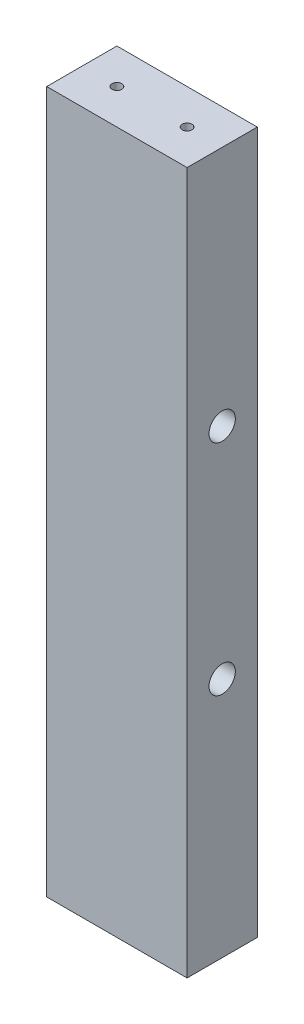
ISO-10303-21;
HEADER;
FILE_DESCRIPTION(('STEP AP214'),'2;1');
FILE_NAME('part.step','',(''),(''),'','','');
FILE_SCHEMA(('AUTOMOTIVE_DESIGN { 1 0 10303 214 1 1 1 1 }'));
ENDSEC;
DATA;
#1=APPLICATION_CONTEXT('core data for automotive mechanical design processes');
#2=APPLICATION_PROTOCOL_DEFINITION('international standard','automotive_design',2000,#1);
#3=PRODUCT_CONTEXT('',#1,'mechanical');
#4=PRODUCT('Part','Part','',(#3));
#5=PRODUCT_RELATED_PRODUCT_CATEGORY('part','',(#4));
#6=PRODUCT_DEFINITION_FORMATION('','',#4);
#7=PRODUCT_DEFINITION_CONTEXT('part definition',#1,'design');
#8=PRODUCT_DEFINITION('design','',#6,#7);
#9=PRODUCT_DEFINITION_SHAPE('','',#8);
#10=(LENGTH_UNIT() NAMED_UNIT(*) SI_UNIT(.MILLI.,.METRE.));
#11=(NAMED_UNIT(*) PLANE_ANGLE_UNIT() SI_UNIT($,.RADIAN.));
#12=(NAMED_UNIT(*) SI_UNIT($,.STERADIAN.) SOLID_ANGLE_UNIT());
#13=UNCERTAINTY_MEASURE_WITH_UNIT(LENGTH_MEASURE(1.E-05),#10,'distance_accuracy_value','');
#14=(GEOMETRIC_REPRESENTATION_CONTEXT(3) GLOBAL_UNCERTAINTY_ASSIGNED_CONTEXT((#13)) GLOBAL_UNIT_ASSIGNED_CONTEXT((#10,
#11,#12)) REPRESENTATION_CONTEXT('',''));
#15=CARTESIAN_POINT('',(0.,0.,0.));
#16=DIRECTION('',(0.,0.,1.));
#17=DIRECTION('',(1.,0.,0.));
#18=AXIS2_PLACEMENT_3D('',#15,#16,#17);
#19=CARTESIAN_POINT('',(-12.7,-19.812,0.));
#20=DIRECTION('',(1.,0.,0.));
#21=DIRECTION('',(0.,0.,-1.));
#22=AXIS2_PLACEMENT_3D('',#19,#20,#21);
#23=CYLINDRICAL_SURFACE('',#22,1.190625);
#24=CARTESIAN_POINT('',(-12.7,-19.812,0.));
#25=DIRECTION('',(1.,0.,0.));
#26=DIRECTION('',(0.,0.,-1.));
#27=AXIS2_PLACEMENT_3D('',#24,#25,#26);
#28=CIRCLE('',#27,1.190625);
#29=CARTESIAN_POINT('',(-12.7,-19.812,-1.190625));
#30=VERTEX_POINT('',#29);
#31=EDGE_CURVE('E143',#30,#30,#28,.T.);
#32=ORIENTED_EDGE('',*,*,#31,.F.);
#33=EDGE_LOOP('',(#32));
#34=FACE_BOUND('',#33,.T.);
#35=CARTESIAN_POINT('',(3.175,-19.812,0.));
#36=DIRECTION('',(1.,0.,0.));
#37=DIRECTION('',(0.,0.,-1.));
#38=AXIS2_PLACEMENT_3D('',#35,#36,#37);
#39=CIRCLE('',#38,1.190625);
#40=CARTESIAN_POINT('',(3.175,-19.812,-1.190625));
#41=VERTEX_POINT('',#40);
#42=EDGE_CURVE('E127',#41,#41,#39,.T.);
#43=ORIENTED_EDGE('',*,*,#42,.T.);
#44=EDGE_LOOP('',(#43));
#45=FACE_BOUND('',#44,.T.);
#46=ADVANCED_FACE('F33',(#34,#45),#23,.F.);
#47=CARTESIAN_POINT('',(-12.7,19.812,0.));
#48=DIRECTION('',(1.,0.,0.));
#49=DIRECTION('',(0.,0.,-1.));
#50=AXIS2_PLACEMENT_3D('',#47,#48,#49);
#51=CYLINDRICAL_SURFACE('',#50,1.190625);
#52=CARTESIAN_POINT('',(-12.7,19.812,0.));
#53=DIRECTION('',(1.,0.,0.));
#54=DIRECTION('',(0.,0.,-1.));
#55=AXIS2_PLACEMENT_3D('',#52,#53,#54);
#56=CIRCLE('',#55,1.190625);
#57=CARTESIAN_POINT('',(-12.7,19.812,-1.190625));
#58=VERTEX_POINT('',#57);
#59=EDGE_CURVE('E148',#58,#58,#56,.T.);
#60=ORIENTED_EDGE('',*,*,#59,.F.);
#61=EDGE_LOOP('',(#60));
#62=FACE_BOUND('',#61,.T.);
#63=CARTESIAN_POINT('',(3.175,19.812,0.));
#64=DIRECTION('',(1.,0.,0.));
#65=DIRECTION('',(0.,0.,-1.));
#66=AXIS2_PLACEMENT_3D('',#63,#64,#65);
#67=CIRCLE('',#66,1.190625);
#68=CARTESIAN_POINT('',(3.175,19.812,-1.190625));
#69=VERTEX_POINT('',#68);
#70=EDGE_CURVE('E134',#69,#69,#67,.T.);
#71=ORIENTED_EDGE('',*,*,#70,.T.);
#72=EDGE_LOOP('',(#71));
#73=FACE_BOUND('',#72,.T.);
#74=ADVANCED_FACE('F192',(#62,#73),#51,.F.);
#75=CARTESIAN_POINT('',(12.7,-63.5,6.35));
#76=DIRECTION('',(-1.,0.,0.));
#77=DIRECTION('',(0.,0.,1.));
#78=AXIS2_PLACEMENT_3D('',#75,#76,#77);
#79=PLANE('',#78);
#80=CARTESIAN_POINT('',(12.7,-19.812,0.));
#81=DIRECTION('',(1.,0.,0.));
#82=DIRECTION('',(0.,0.,-1.));
#83=AXIS2_PLACEMENT_3D('',#80,#81,#82);
#84=CIRCLE('',#83,2.38125);
#85=CARTESIAN_POINT('',(12.7,-19.812,-2.38125));
#86=VERTEX_POINT('',#85);
#87=EDGE_CURVE('E130',#86,#86,#84,.T.);
#88=ORIENTED_EDGE('',*,*,#87,.F.);
#89=EDGE_LOOP('',(#88));
#90=FACE_BOUND('',#89,.T.);
#91=CARTESIAN_POINT('',(12.7,19.812,0.));
#92=DIRECTION('',(1.,0.,0.));
#93=DIRECTION('',(0.,0.,-1.));
#94=AXIS2_PLACEMENT_3D('',#91,#92,#93);
#95=CIRCLE('',#94,2.38125);
#96=CARTESIAN_POINT('',(12.7,19.812,-2.38125));
#97=VERTEX_POINT('',#96);
#98=EDGE_CURVE('E139',#97,#97,#95,.T.);
#99=ORIENTED_EDGE('',*,*,#98,.F.);
#100=EDGE_LOOP('',(#99));
#101=FACE_BOUND('',#100,.T.);
#102=DIRECTION('',(0.,1.,0.));
#103=VECTOR('',#102,1.);
#104=CARTESIAN_POINT('',(12.7,-63.5,-6.35));
#105=LINE('',#104,#103);
#106=CARTESIAN_POINT('',(12.7,-63.5,-6.35));
#107=VERTEX_POINT('',#106);
#108=CARTESIAN_POINT('',(12.7,63.5,-6.35));
#109=VERTEX_POINT('',#108);
#110=EDGE_CURVE('E151',#107,#109,#105,.T.);
#111=ORIENTED_EDGE('',*,*,#110,.T.);
#112=DIRECTION('',(0.,0.,-1.));
#113=VECTOR('',#112,1.);
#114=CARTESIAN_POINT('',(12.7,63.5,6.35));
#115=LINE('',#114,#113);
#116=CARTESIAN_POINT('',(12.7,63.5,6.35));
#117=VERTEX_POINT('',#116);
#118=EDGE_CURVE('E11',#117,#109,#115,.T.);
#119=ORIENTED_EDGE('',*,*,#118,.F.);
#120=DIRECTION('',(0.,1.,0.));
#121=VECTOR('',#120,1.);
#122=CARTESIAN_POINT('',(12.7,-63.5,6.35));
#123=LINE('',#122,#121);
#124=CARTESIAN_POINT('',(12.7,-63.5,6.35));
#125=VERTEX_POINT('',#124);
#126=EDGE_CURVE('E152',#125,#117,#123,.T.);
#127=ORIENTED_EDGE('',*,*,#126,.F.);
#128=DIRECTION('',(0.,0.,-1.));
#129=VECTOR('',#128,1.);
#130=CARTESIAN_POINT('',(12.7,-63.5,6.35));
#131=LINE('',#130,#129);
#132=EDGE_CURVE('E158',#125,#107,#131,.T.);
#133=ORIENTED_EDGE('',*,*,#132,.T.);
#134=EDGE_LOOP('',(#111,#119,#127,#133));
#135=FACE_BOUND('',#134,.T.);
#136=ADVANCED_FACE('F35',(#90,#101,#135),#79,.F.);
#137=CARTESIAN_POINT('',(-12.7,63.5,6.35));
#138=DIRECTION('',(0.,-1.,0.));
#139=DIRECTION('',(0.,0.,-1.));
#140=AXIS2_PLACEMENT_3D('',#137,#138,#139);
#141=PLANE('',#140);
#142=CARTESIAN_POINT('',(-6.35000000000004,63.5,0.));
#143=DIRECTION('',(0.,1.,0.));
#144=DIRECTION('',(0.,0.,1.));
#145=AXIS2_PLACEMENT_3D('',#142,#143,#144);
#146=CIRCLE('',#145,0.888999999999989);
#147=CARTESIAN_POINT('',(-6.35000000000004,63.5,0.889000000000044));
#148=VERTEX_POINT('',#147);
#149=EDGE_CURVE('E115',#148,#148,#146,.T.);
#150=ORIENTED_EDGE('',*,*,#149,.F.);
#151=EDGE_LOOP('',(#150));
#152=FACE_BOUND('',#151,.T.);
#153=CARTESIAN_POINT('',(6.34999999999996,63.5,0.));
#154=DIRECTION('',(0.,1.,0.));
#155=DIRECTION('',(0.,0.,1.));
#156=AXIS2_PLACEMENT_3D('',#153,#154,#155);
#157=CIRCLE('',#156,0.888999999999989);
#158=CARTESIAN_POINT('',(6.34999999999996,63.5,0.889000000000044));
#159=VERTEX_POINT('',#158);
#160=EDGE_CURVE('E121',#159,#159,#157,.T.);
#161=ORIENTED_EDGE('',*,*,#160,.F.);
#162=EDGE_LOOP('',(#161));
#163=FACE_BOUND('',#162,.T.);
#164=DIRECTION('',(-1.,0.,0.));
#165=VECTOR('',#164,1.);
#166=CARTESIAN_POINT('',(-12.7,63.5,-6.35));
#167=LINE('',#166,#165);
#168=CARTESIAN_POINT('',(-12.7,63.5,-6.35));
#169=VERTEX_POINT('',#168);
#170=EDGE_CURVE('E161',#109,#169,#167,.T.);
#171=ORIENTED_EDGE('',*,*,#170,.T.);
#172=DIRECTION('',(0.,0.,-1.));
#173=VECTOR('',#172,1.);
#174=CARTESIAN_POINT('',(-12.7,63.5,6.35));
#175=LINE('',#174,#173);
#176=CARTESIAN_POINT('',(-12.7,63.5,6.35));
#177=VERTEX_POINT('',#176);
#178=EDGE_CURVE('E42',#177,#169,#175,.T.);
#179=ORIENTED_EDGE('',*,*,#178,.F.);
#180=DIRECTION('',(-1.,0.,0.));
#181=VECTOR('',#180,1.);
#182=CARTESIAN_POINT('',(-12.7,63.5,6.35));
#183=LINE('',#182,#181);
#184=EDGE_CURVE('E81',#117,#177,#183,.T.);
#185=ORIENTED_EDGE('',*,*,#184,.F.);
#186=ORIENTED_EDGE('',*,*,#118,.T.);
#187=EDGE_LOOP('',(#171,#179,#185,#186));
#188=FACE_BOUND('',#187,.T.);
#189=ADVANCED_FACE('F185',(#152,#163,#188),#141,.F.);
#190=CARTESIAN_POINT('',(-12.7,-63.5,6.35));
#191=DIRECTION('',(1.,0.,0.));
#192=DIRECTION('',(0.,0.,-1.));
#193=AXIS2_PLACEMENT_3D('',#190,#191,#192);
#194=PLANE('',#193);
#195=ORIENTED_EDGE('',*,*,#31,.T.);
#196=EDGE_LOOP('',(#195));
#197=FACE_BOUND('',#196,.T.);
#198=ORIENTED_EDGE('',*,*,#59,.T.);
#199=EDGE_LOOP('',(#198));
#200=FACE_BOUND('',#199,.T.);
#201=DIRECTION('',(0.,-1.,0.));
#202=VECTOR('',#201,1.);
#203=CARTESIAN_POINT('',(-12.7,-63.5,-6.35));
#204=LINE('',#203,#202);
#205=CARTESIAN_POINT('',(-12.7,-63.5,-6.35));
#206=VERTEX_POINT('',#205);
#207=EDGE_CURVE('E68',#169,#206,#204,.T.);
#208=ORIENTED_EDGE('',*,*,#207,.T.);
#209=DIRECTION('',(0.,0.,-1.));
#210=VECTOR('',#209,1.);
#211=CARTESIAN_POINT('',(-12.7,-63.5,6.35));
#212=LINE('',#211,#210);
#213=CARTESIAN_POINT('',(-12.7,-63.5,6.35));
#214=VERTEX_POINT('',#213);
#215=EDGE_CURVE('E166',#214,#206,#212,.T.);
#216=ORIENTED_EDGE('',*,*,#215,.F.);
#217=DIRECTION('',(0.,-1.,0.));
#218=VECTOR('',#217,1.);
#219=CARTESIAN_POINT('',(-12.7,-63.5,6.35));
#220=LINE('',#219,#218);
#221=EDGE_CURVE('E155',#177,#214,#220,.T.);
#222=ORIENTED_EDGE('',*,*,#221,.F.);
#223=ORIENTED_EDGE('',*,*,#178,.T.);
#224=EDGE_LOOP('',(#208,#216,#222,#223));
#225=FACE_BOUND('',#224,.T.);
#226=ADVANCED_FACE('F168',(#197,#200,#225),#194,.F.);
#227=CARTESIAN_POINT('',(-12.7,-63.5,6.35));
#228=DIRECTION('',(0.,1.,0.));
#229=DIRECTION('',(0.,0.,1.));
#230=AXIS2_PLACEMENT_3D('',#227,#228,#229);
#231=PLANE('',#230);
#232=CARTESIAN_POINT('',(6.34999999999996,-63.5,0.));
#233=DIRECTION('',(0.,-1.,0.));
#234=DIRECTION('',(0.,0.,-1.));
#235=AXIS2_PLACEMENT_3D('',#232,#233,#234);
#236=CIRCLE('',#235,0.888999999999989);
#237=CARTESIAN_POINT('',(6.34999999999996,-63.5,-0.888999999999892));
#238=VERTEX_POINT('',#237);
#239=EDGE_CURVE('E105',#238,#238,#236,.T.);
#240=ORIENTED_EDGE('',*,*,#239,.F.);
#241=EDGE_LOOP('',(#240));
#242=FACE_BOUND('',#241,.T.);
#243=CARTESIAN_POINT('',(-6.35000000000004,-63.5,0.));
#244=DIRECTION('',(0.,-1.,0.));
#245=DIRECTION('',(0.,0.,-1.));
#246=AXIS2_PLACEMENT_3D('',#243,#244,#245);
#247=CIRCLE('',#246,0.888999999999989);
#248=CARTESIAN_POINT('',(-6.35000000000004,-63.5,-0.888999999999892));
#249=VERTEX_POINT('',#248);
#250=EDGE_CURVE('E104',#249,#249,#247,.T.);
#251=ORIENTED_EDGE('',*,*,#250,.F.);
#252=EDGE_LOOP('',(#251));
#253=FACE_BOUND('',#252,.T.);
#254=DIRECTION('',(1.,0.,0.));
#255=VECTOR('',#254,1.);
#256=CARTESIAN_POINT('',(-12.7,-63.5,-6.35));
#257=LINE('',#256,#255);
#258=EDGE_CURVE('E74',#206,#107,#257,.T.);
#259=ORIENTED_EDGE('',*,*,#258,.T.);
#260=ORIENTED_EDGE('',*,*,#132,.F.);
#261=DIRECTION('',(1.,0.,0.));
#262=VECTOR('',#261,1.);
#263=CARTESIAN_POINT('',(-12.7,-63.5,6.35));
#264=LINE('',#263,#262);
#265=EDGE_CURVE('E50',#214,#125,#264,.T.);
#266=ORIENTED_EDGE('',*,*,#265,.F.);
#267=ORIENTED_EDGE('',*,*,#215,.T.);
#268=EDGE_LOOP('',(#259,#260,#266,#267));
#269=FACE_BOUND('',#268,.T.);
#270=ADVANCED_FACE('F175',(#242,#253,#269),#231,.F.);
#271=CARTESIAN_POINT('',(12.7,63.5,6.35));
#272=DIRECTION('',(0.,0.,-1.));
#273=DIRECTION('',(-1.,0.,0.));
#274=AXIS2_PLACEMENT_3D('',#271,#272,#273);
#275=PLANE('',#274);
#276=ORIENTED_EDGE('',*,*,#126,.T.);
#277=ORIENTED_EDGE('',*,*,#184,.T.);
#278=ORIENTED_EDGE('',*,*,#221,.T.);
#279=ORIENTED_EDGE('',*,*,#265,.T.);
#280=EDGE_LOOP('',(#276,#277,#278,#279));
#281=FACE_BOUND('',#280,.T.);
#282=ADVANCED_FACE('F177',(#281),#275,.F.);
#283=CARTESIAN_POINT('',(12.7,63.5,-6.35));
#284=DIRECTION('',(0.,0.,-1.));
#285=DIRECTION('',(-1.,0.,0.));
#286=AXIS2_PLACEMENT_3D('',#283,#284,#285);
#287=PLANE('',#286);
#288=ORIENTED_EDGE('',*,*,#110,.F.);
#289=ORIENTED_EDGE('',*,*,#258,.F.);
#290=ORIENTED_EDGE('',*,*,#207,.F.);
#291=ORIENTED_EDGE('',*,*,#170,.F.);
#292=EDGE_LOOP('',(#288,#289,#290,#291));
#293=FACE_BOUND('',#292,.T.);
#294=ADVANCED_FACE('F171',(#293),#287,.T.);
#295=CARTESIAN_POINT('',(3.175,19.812,0.));
#296=DIRECTION('',(1.,0.,0.));
#297=DIRECTION('',(0.,0.,-1.));
#298=AXIS2_PLACEMENT_3D('',#295,#296,#297);
#299=CYLINDRICAL_SURFACE('',#298,2.38125);
#300=CARTESIAN_POINT('',(3.175,19.812,0.));
#301=DIRECTION('',(1.,0.,0.));
#302=DIRECTION('',(0.,0.,-1.));
#303=AXIS2_PLACEMENT_3D('',#300,#301,#302);
#304=CIRCLE('',#303,2.38125);
#305=CARTESIAN_POINT('',(3.175,19.812,-2.38125));
#306=VERTEX_POINT('',#305);
#307=EDGE_CURVE('E140',#306,#306,#304,.T.);
#308=ORIENTED_EDGE('',*,*,#307,.F.);
#309=EDGE_LOOP('',(#308));
#310=FACE_BOUND('',#309,.T.);
#311=ORIENTED_EDGE('',*,*,#98,.T.);
#312=EDGE_LOOP('',(#311));
#313=FACE_BOUND('',#312,.T.);
#314=ADVANCED_FACE('F203',(#310,#313),#299,.F.);
#315=CARTESIAN_POINT('',(3.175,19.812,0.));
#316=DIRECTION('',(1.,0.,0.));
#317=DIRECTION('',(0.,0.,-1.));
#318=AXIS2_PLACEMENT_3D('',#315,#316,#317);
#319=PLANE('',#318);
#320=ORIENTED_EDGE('',*,*,#70,.F.);
#321=EDGE_LOOP('',(#320));
#322=FACE_BOUND('',#321,.T.);
#323=ORIENTED_EDGE('',*,*,#307,.T.);
#324=EDGE_LOOP('',(#323));
#325=FACE_BOUND('',#324,.T.);
#326=ADVANCED_FACE('F209',(#322,#325),#319,.T.);
#327=CARTESIAN_POINT('',(3.175,-19.812,0.));
#328=DIRECTION('',(1.,0.,0.));
#329=DIRECTION('',(0.,0.,-1.));
#330=AXIS2_PLACEMENT_3D('',#327,#328,#329);
#331=CYLINDRICAL_SURFACE('',#330,2.38125);
#332=CARTESIAN_POINT('',(3.175,-19.812,0.));
#333=DIRECTION('',(1.,0.,0.));
#334=DIRECTION('',(0.,0.,-1.));
#335=AXIS2_PLACEMENT_3D('',#332,#333,#334);
#336=CIRCLE('',#335,2.38125);
#337=CARTESIAN_POINT('',(3.175,-19.812,-2.38125));
#338=VERTEX_POINT('',#337);
#339=EDGE_CURVE('E131',#338,#338,#336,.T.);
#340=ORIENTED_EDGE('',*,*,#339,.F.);
#341=EDGE_LOOP('',(#340));
#342=FACE_BOUND('',#341,.T.);
#343=ORIENTED_EDGE('',*,*,#87,.T.);
#344=EDGE_LOOP('',(#343));
#345=FACE_BOUND('',#344,.T.);
#346=ADVANCED_FACE('F214',(#342,#345),#331,.F.);
#347=CARTESIAN_POINT('',(3.175,-19.812,0.));
#348=DIRECTION('',(1.,0.,0.));
#349=DIRECTION('',(0.,0.,-1.));
#350=AXIS2_PLACEMENT_3D('',#347,#348,#349);
#351=PLANE('',#350);
#352=ORIENTED_EDGE('',*,*,#42,.F.);
#353=EDGE_LOOP('',(#352));
#354=FACE_BOUND('',#353,.T.);
#355=ORIENTED_EDGE('',*,*,#339,.T.);
#356=EDGE_LOOP('',(#355));
#357=FACE_BOUND('',#356,.T.);
#358=ADVANCED_FACE('F229',(#354,#357),#351,.T.);
#359=CARTESIAN_POINT('',(6.34999999999996,52.832,0.));
#360=DIRECTION('',(0.,1.,0.));
#361=DIRECTION('',(0.,0.,1.));
#362=AXIS2_PLACEMENT_3D('',#359,#360,#361);
#363=CONICAL_SURFACE('',#362,0.888999999999997,1.02974425867665);
#364=CARTESIAN_POINT('',(6.34999999999996,52.2978349096845,0.));
#365=VERTEX_POINT('',#364);
#366=VERTEX_LOOP('',#365);
#367=FACE_BOUND('',#366,.T.);
#368=CARTESIAN_POINT('',(6.34999999999996,52.832,0.));
#369=DIRECTION('',(0.,1.,0.));
#370=DIRECTION('',(0.,0.,1.));
#371=AXIS2_PLACEMENT_3D('',#368,#369,#370);
#372=CIRCLE('',#371,0.888999999999997);
#373=CARTESIAN_POINT('',(6.34999999999996,52.832,0.889000000000053));
#374=VERTEX_POINT('',#373);
#375=EDGE_CURVE('E124',#374,#374,#372,.T.);
#376=ORIENTED_EDGE('',*,*,#375,.T.);
#377=EDGE_LOOP('',(#376));
#378=FACE_BOUND('',#377,.T.);
#379=ADVANCED_FACE('F235',(#367,#378),#363,.F.);
#380=CARTESIAN_POINT('',(6.34999999999996,63.5,0.));
#381=DIRECTION('',(0.,1.,0.));
#382=DIRECTION('',(0.,0.,1.));
#383=AXIS2_PLACEMENT_3D('',#380,#381,#382);
#384=CYLINDRICAL_SURFACE('',#383,0.888999999999993);
#385=ORIENTED_EDGE('',*,*,#375,.F.);
#386=EDGE_LOOP('',(#385));
#387=FACE_BOUND('',#386,.T.);
#388=ORIENTED_EDGE('',*,*,#160,.T.);
#389=EDGE_LOOP('',(#388));
#390=FACE_BOUND('',#389,.T.);
#391=ADVANCED_FACE('F242',(#387,#390),#384,.F.);
#392=CARTESIAN_POINT('',(-6.35000000000004,52.832,0.));
#393=DIRECTION('',(0.,1.,0.));
#394=DIRECTION('',(0.,0.,1.));
#395=AXIS2_PLACEMENT_3D('',#392,#393,#394);
#396=CONICAL_SURFACE('',#395,0.888999999999997,1.02974425867665);
#397=CARTESIAN_POINT('',(-6.35000000000004,52.2978349096845,0.));
#398=VERTEX_POINT('',#397);
#399=VERTEX_LOOP('',#398);
#400=FACE_BOUND('',#399,.T.);
#401=CARTESIAN_POINT('',(-6.35000000000004,52.832,0.));
#402=DIRECTION('',(0.,1.,0.));
#403=DIRECTION('',(0.,0.,1.));
#404=AXIS2_PLACEMENT_3D('',#401,#402,#403);
#405=CIRCLE('',#404,0.888999999999997);
#406=CARTESIAN_POINT('',(-6.35000000000004,52.832,0.889000000000053));
#407=VERTEX_POINT('',#406);
#408=EDGE_CURVE('E118',#407,#407,#405,.T.);
#409=ORIENTED_EDGE('',*,*,#408,.T.);
#410=EDGE_LOOP('',(#409));
#411=FACE_BOUND('',#410,.T.);
#412=ADVANCED_FACE('F246',(#400,#411),#396,.F.);
#413=CARTESIAN_POINT('',(-6.35000000000004,63.5,0.));
#414=DIRECTION('',(0.,1.,0.));
#415=DIRECTION('',(0.,0.,1.));
#416=AXIS2_PLACEMENT_3D('',#413,#414,#415);
#417=CYLINDRICAL_SURFACE('',#416,0.888999999999993);
#418=ORIENTED_EDGE('',*,*,#408,.F.);
#419=EDGE_LOOP('',(#418));
#420=FACE_BOUND('',#419,.T.);
#421=ORIENTED_EDGE('',*,*,#149,.T.);
#422=EDGE_LOOP('',(#421));
#423=FACE_BOUND('',#422,.T.);
#424=ADVANCED_FACE('F250',(#420,#423),#417,.F.);
#425=CARTESIAN_POINT('',(-6.35000000000004,-52.832,0.));
#426=DIRECTION('',(0.,-1.,0.));
#427=DIRECTION('',(0.,0.,-1.));
#428=AXIS2_PLACEMENT_3D('',#425,#426,#427);
#429=CONICAL_SURFACE('',#428,0.888999999999987,1.02974425867665);
#430=CARTESIAN_POINT('',(-6.35000000000005,-52.2978349096845,0.));
#431=VERTEX_POINT('',#430);
#432=VERTEX_LOOP('',#431);
#433=FACE_BOUND('',#432,.T.);
#434=CARTESIAN_POINT('',(-6.35000000000004,-52.832,0.));
#435=DIRECTION('',(0.,-1.,0.));
#436=DIRECTION('',(0.,0.,-1.));
#437=AXIS2_PLACEMENT_3D('',#434,#435,#436);
#438=CIRCLE('',#437,0.888999999999987);
#439=CARTESIAN_POINT('',(-6.35000000000004,-52.832,-0.88899999999989));
#440=VERTEX_POINT('',#439);
#441=EDGE_CURVE('E108',#440,#440,#438,.T.);
#442=ORIENTED_EDGE('',*,*,#441,.T.);
#443=EDGE_LOOP('',(#442));
#444=FACE_BOUND('',#443,.T.);
#445=ADVANCED_FACE('F254',(#433,#444),#429,.F.);
#446=CARTESIAN_POINT('',(-6.35000000000004,-63.5,0.));
#447=DIRECTION('',(0.,-1.,0.));
#448=DIRECTION('',(0.,0.,-1.));
#449=AXIS2_PLACEMENT_3D('',#446,#447,#448);
#450=CYLINDRICAL_SURFACE('',#449,0.888999999999988);
#451=ORIENTED_EDGE('',*,*,#441,.F.);
#452=EDGE_LOOP('',(#451));
#453=FACE_BOUND('',#452,.T.);
#454=ORIENTED_EDGE('',*,*,#250,.T.);
#455=EDGE_LOOP('',(#454));
#456=FACE_BOUND('',#455,.T.);
#457=ADVANCED_FACE('F98',(#453,#456),#450,.F.);
#458=CARTESIAN_POINT('',(6.34999999999996,-52.832,0.));
#459=DIRECTION('',(0.,-1.,0.));
#460=DIRECTION('',(0.,0.,-1.));
#461=AXIS2_PLACEMENT_3D('',#458,#459,#460);
#462=CONICAL_SURFACE('',#461,0.888999999999987,1.02974425867665);
#463=CARTESIAN_POINT('',(6.34999999999996,-52.2978349096845,0.));
#464=VERTEX_POINT('',#463);
#465=VERTEX_LOOP('',#464);
#466=FACE_BOUND('',#465,.T.);
#467=CARTESIAN_POINT('',(6.34999999999996,-52.832,0.));
#468=DIRECTION('',(0.,-1.,0.));
#469=DIRECTION('',(0.,0.,-1.));
#470=AXIS2_PLACEMENT_3D('',#467,#468,#469);
#471=CIRCLE('',#470,0.888999999999987);
#472=CARTESIAN_POINT('',(6.34999999999996,-52.832,-0.88899999999989));
#473=VERTEX_POINT('',#472);
#474=EDGE_CURVE('E102',#473,#473,#471,.T.);
#475=ORIENTED_EDGE('',*,*,#474,.T.);
#476=EDGE_LOOP('',(#475));
#477=FACE_BOUND('',#476,.T.);
#478=ADVANCED_FACE('F94',(#466,#477),#462,.F.);
#479=CARTESIAN_POINT('',(6.34999999999996,-63.5,0.));
#480=DIRECTION('',(0.,-1.,0.));
#481=DIRECTION('',(0.,0.,-1.));
#482=AXIS2_PLACEMENT_3D('',#479,#480,#481);
#483=CYLINDRICAL_SURFACE('',#482,0.888999999999988);
#484=ORIENTED_EDGE('',*,*,#474,.F.);
#485=EDGE_LOOP('',(#484));
#486=FACE_BOUND('',#485,.T.);
#487=ORIENTED_EDGE('',*,*,#239,.T.);
#488=EDGE_LOOP('',(#487));
#489=FACE_BOUND('',#488,.T.);
#490=ADVANCED_FACE('F97',(#486,#489),#483,.F.);
#491=CLOSED_SHELL('',(#46,#74,#136,#189,#226,#270,#282,#294,#314,#326,#346,#358,#379,#391,#412,
#424,#445,#457,#478,#490));
#492=MANIFOLD_SOLID_BREP('B2',#491);
#493=ADVANCED_BREP_SHAPE_REPRESENTATION('',(#18,#492),#14);
#494=SHAPE_DEFINITION_REPRESENTATION(#9,#493);
ENDSEC;
END-ISO-10303-21;
